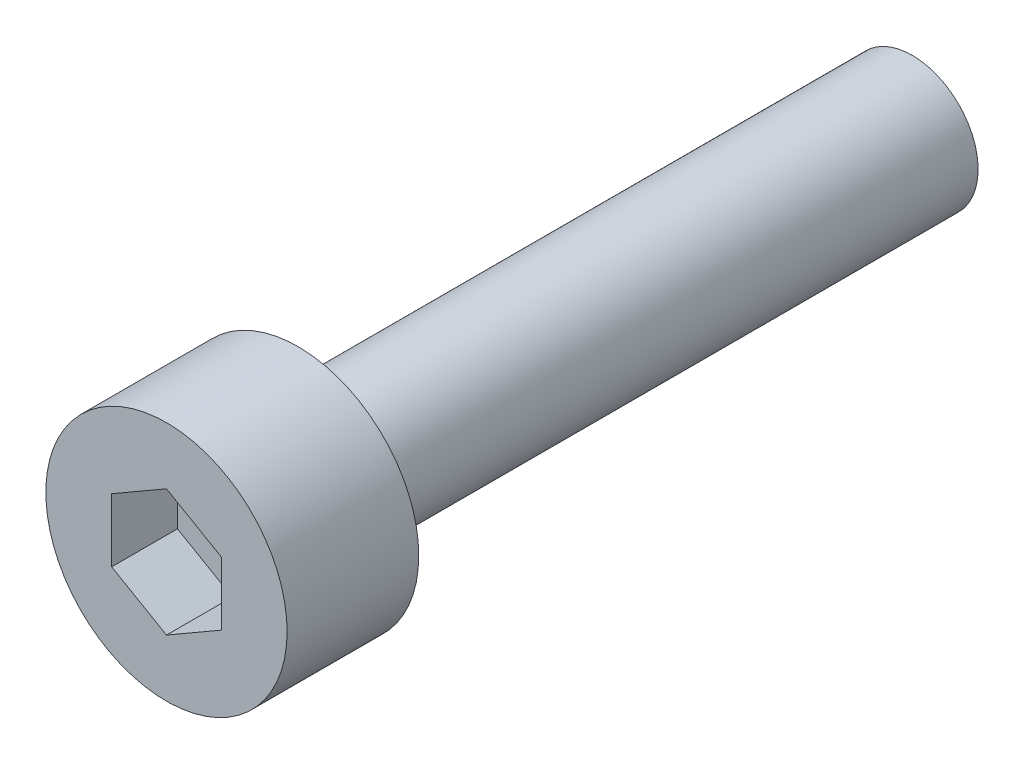
ISO-10303-21;
HEADER;
FILE_DESCRIPTION(('STEP AP214'),'2;1');
FILE_NAME('part.step','',(''),(''),'','','');
FILE_SCHEMA(('AUTOMOTIVE_DESIGN { 1 0 10303 214 1 1 1 1 }'));
ENDSEC;
DATA;
#1=APPLICATION_CONTEXT('core data for automotive mechanical design processes');
#2=APPLICATION_PROTOCOL_DEFINITION('international standard','automotive_design',2000,#1);
#3=PRODUCT_CONTEXT('',#1,'mechanical');
#4=PRODUCT('Part','Part','',(#3));
#5=PRODUCT_RELATED_PRODUCT_CATEGORY('part','',(#4));
#6=PRODUCT_DEFINITION_FORMATION('','',#4);
#7=PRODUCT_DEFINITION_CONTEXT('part definition',#1,'design');
#8=PRODUCT_DEFINITION('design','',#6,#7);
#9=PRODUCT_DEFINITION_SHAPE('','',#8);
#10=(LENGTH_UNIT() NAMED_UNIT(*) SI_UNIT(.MILLI.,.METRE.));
#11=(NAMED_UNIT(*) PLANE_ANGLE_UNIT() SI_UNIT($,.RADIAN.));
#12=(NAMED_UNIT(*) SI_UNIT($,.STERADIAN.) SOLID_ANGLE_UNIT());
#13=UNCERTAINTY_MEASURE_WITH_UNIT(LENGTH_MEASURE(1.E-05),#10,'distance_accuracy_value','');
#14=(GEOMETRIC_REPRESENTATION_CONTEXT(3) GLOBAL_UNCERTAINTY_ASSIGNED_CONTEXT((#13)) GLOBAL_UNIT_ASSIGNED_CONTEXT((#10,
#11,#12)) REPRESENTATION_CONTEXT('',''));
#15=CARTESIAN_POINT('',(0.,0.,0.));
#16=DIRECTION('',(0.,0.,1.));
#17=DIRECTION('',(1.,0.,0.));
#18=AXIS2_PLACEMENT_3D('',#15,#16,#17);
#19=CARTESIAN_POINT('',(0.,0.,3.));
#20=DIRECTION('',(0.,0.,-1.));
#21=DIRECTION('',(-1.,0.,0.));
#22=AXIS2_PLACEMENT_3D('',#19,#20,#21);
#23=CYLINDRICAL_SURFACE('',#22,2.75);
#24=CARTESIAN_POINT('',(0.,0.,3.));
#25=DIRECTION('',(0.,0.,1.));
#26=DIRECTION('',(1.,0.,0.));
#27=AXIS2_PLACEMENT_3D('',#24,#25,#26);
#28=CIRCLE('',#27,2.75);
#29=CARTESIAN_POINT('',(2.75,0.,3.));
#30=VERTEX_POINT('',#29);
#31=EDGE_CURVE('E52',#30,#30,#28,.T.);
#32=ORIENTED_EDGE('',*,*,#31,.F.);
#33=EDGE_LOOP('',(#32));
#34=FACE_BOUND('',#33,.T.);
#35=CARTESIAN_POINT('',(0.,0.,0.));
#36=DIRECTION('',(0.,0.,1.));
#37=DIRECTION('',(1.,0.,0.));
#38=AXIS2_PLACEMENT_3D('',#35,#36,#37);
#39=CIRCLE('',#38,2.75);
#40=CARTESIAN_POINT('',(2.75,0.,0.));
#41=VERTEX_POINT('',#40);
#42=EDGE_CURVE('E46',#41,#41,#39,.T.);
#43=ORIENTED_EDGE('',*,*,#42,.T.);
#44=EDGE_LOOP('',(#43));
#45=FACE_BOUND('',#44,.T.);
#46=ADVANCED_FACE('F43',(#34,#45),#23,.T.);
#47=CARTESIAN_POINT('',(0.,0.,3.));
#48=DIRECTION('',(0.,0.,1.));
#49=DIRECTION('',(1.,0.,0.));
#50=AXIS2_PLACEMENT_3D('',#47,#48,#49);
#51=PLANE('',#50);
#52=DIRECTION('',(0.866025403784439,-0.5,0.));
#53=VECTOR('',#52,1.);
#54=CARTESIAN_POINT('',(-1.25,-0.721687836487032,3.));
#55=LINE('',#54,#53);
#56=CARTESIAN_POINT('',(-1.25,-0.721687836487032,3.));
#57=VERTEX_POINT('',#56);
#58=CARTESIAN_POINT('',(0.,-1.44337567297406,3.));
#59=VERTEX_POINT('',#58);
#60=EDGE_CURVE('E60',#57,#59,#55,.T.);
#61=ORIENTED_EDGE('',*,*,#60,.F.);
#62=DIRECTION('',(0.,-1.,0.));
#63=VECTOR('',#62,1.);
#64=CARTESIAN_POINT('',(-1.25,0.721687836487032,3.));
#65=LINE('',#64,#63);
#66=CARTESIAN_POINT('',(-1.25,0.721687836487032,3.));
#67=VERTEX_POINT('',#66);
#68=EDGE_CURVE('E154',#67,#57,#65,.T.);
#69=ORIENTED_EDGE('',*,*,#68,.F.);
#70=DIRECTION('',(-0.866025403784438,-0.5,0.));
#71=VECTOR('',#70,1.);
#72=CARTESIAN_POINT('',(0.,1.44337567297407,3.));
#73=LINE('',#72,#71);
#74=CARTESIAN_POINT('',(0.,1.44337567297407,3.));
#75=VERTEX_POINT('',#74);
#76=EDGE_CURVE('E151',#75,#67,#73,.T.);
#77=ORIENTED_EDGE('',*,*,#76,.F.);
#78=DIRECTION('',(-0.866025403784439,0.5,0.));
#79=VECTOR('',#78,1.);
#80=CARTESIAN_POINT('',(1.25,0.721687836487033,3.));
#81=LINE('',#80,#79);
#82=CARTESIAN_POINT('',(1.25,0.721687836487033,3.));
#83=VERTEX_POINT('',#82);
#84=EDGE_CURVE('E108',#83,#75,#81,.T.);
#85=ORIENTED_EDGE('',*,*,#84,.F.);
#86=DIRECTION('',(0.,1.,0.));
#87=VECTOR('',#86,1.);
#88=CARTESIAN_POINT('',(1.25,-0.721687836487032,3.));
#89=LINE('',#88,#87);
#90=CARTESIAN_POINT('',(1.25,-0.721687836487032,3.));
#91=VERTEX_POINT('',#90);
#92=EDGE_CURVE('E145',#91,#83,#89,.T.);
#93=ORIENTED_EDGE('',*,*,#92,.F.);
#94=DIRECTION('',(0.866025403784439,0.5,0.));
#95=VECTOR('',#94,1.);
#96=CARTESIAN_POINT('',(0.,-1.44337567297406,3.));
#97=LINE('',#96,#95);
#98=EDGE_CURVE('E140',#59,#91,#97,.T.);
#99=ORIENTED_EDGE('',*,*,#98,.F.);
#100=EDGE_LOOP('',(#61,#69,#77,#85,#93,#99));
#101=FACE_BOUND('',#100,.T.);
#102=ORIENTED_EDGE('',*,*,#31,.T.);
#103=EDGE_LOOP('',(#102));
#104=FACE_BOUND('',#103,.T.);
#105=ADVANCED_FACE('F180',(#101,#104),#51,.T.);
#106=CARTESIAN_POINT('',(0.,0.,0.));
#107=DIRECTION('',(0.,0.,1.));
#108=DIRECTION('',(1.,0.,0.));
#109=AXIS2_PLACEMENT_3D('',#106,#107,#108);
#110=PLANE('',#109);
#111=CARTESIAN_POINT('',(0.,0.,0.));
#112=DIRECTION('',(0.,0.,-1.));
#113=DIRECTION('',(-1.,0.,0.));
#114=AXIS2_PLACEMENT_3D('',#111,#112,#113);
#115=CIRCLE('',#114,1.5);
#116=CARTESIAN_POINT('',(-1.5,0.,0.));
#117=VERTEX_POINT('',#116);
#118=EDGE_CURVE('E11',#117,#117,#115,.T.);
#119=ORIENTED_EDGE('',*,*,#118,.F.);
#120=EDGE_LOOP('',(#119));
#121=FACE_BOUND('',#120,.T.);
#122=ORIENTED_EDGE('',*,*,#42,.F.);
#123=EDGE_LOOP('',(#122));
#124=FACE_BOUND('',#123,.T.);
#125=ADVANCED_FACE('F177',(#121,#124),#110,.F.);
#126=CARTESIAN_POINT('',(-1.25,-0.721687836487032,1.5));
#127=DIRECTION('',(-0.5,-0.866025403784439,0.));
#128=DIRECTION('',(0.866025403784439,-0.5,0.));
#129=AXIS2_PLACEMENT_3D('',#126,#127,#128);
#130=PLANE('',#129);
#131=ORIENTED_EDGE('',*,*,#60,.T.);
#132=DIRECTION('',(0.,0.,1.));
#133=VECTOR('',#132,1.);
#134=CARTESIAN_POINT('',(0.,-1.44337567297406,1.5));
#135=LINE('',#134,#133);
#136=CARTESIAN_POINT('',(0.,-1.44337567297406,1.5));
#137=VERTEX_POINT('',#136);
#138=EDGE_CURVE('E90',#137,#59,#135,.T.);
#139=ORIENTED_EDGE('',*,*,#138,.F.);
#140=DIRECTION('',(0.866025403784439,-0.5,0.));
#141=VECTOR('',#140,1.);
#142=CARTESIAN_POINT('',(-1.25,-0.721687836487032,1.5));
#143=LINE('',#142,#141);
#144=CARTESIAN_POINT('',(-1.25,-0.721687836487032,1.5));
#145=VERTEX_POINT('',#144);
#146=EDGE_CURVE('E157',#145,#137,#143,.T.);
#147=ORIENTED_EDGE('',*,*,#146,.F.);
#148=DIRECTION('',(0.,0.,1.));
#149=VECTOR('',#148,1.);
#150=CARTESIAN_POINT('',(-1.25,-0.721687836487032,1.5));
#151=LINE('',#150,#149);
#152=EDGE_CURVE('E68',#145,#57,#151,.T.);
#153=ORIENTED_EDGE('',*,*,#152,.T.);
#154=EDGE_LOOP('',(#131,#139,#147,#153));
#155=FACE_BOUND('',#154,.T.);
#156=ADVANCED_FACE('F179',(#155),#130,.F.);
#157=CARTESIAN_POINT('',(-1.25,0.721687836487032,1.5));
#158=DIRECTION('',(-1.,0.,0.));
#159=DIRECTION('',(0.,0.,1.));
#160=AXIS2_PLACEMENT_3D('',#157,#158,#159);
#161=PLANE('',#160);
#162=ORIENTED_EDGE('',*,*,#68,.T.);
#163=ORIENTED_EDGE('',*,*,#152,.F.);
#164=DIRECTION('',(0.,-1.,0.));
#165=VECTOR('',#164,1.);
#166=CARTESIAN_POINT('',(-1.25,0.721687836487032,1.5));
#167=LINE('',#166,#165);
#168=CARTESIAN_POINT('',(-1.25,0.721687836487032,1.5));
#169=VERTEX_POINT('',#168);
#170=EDGE_CURVE('E122',#169,#145,#167,.T.);
#171=ORIENTED_EDGE('',*,*,#170,.F.);
#172=DIRECTION('',(0.,0.,1.));
#173=VECTOR('',#172,1.);
#174=CARTESIAN_POINT('',(-1.25,0.721687836487032,1.5));
#175=LINE('',#174,#173);
#176=EDGE_CURVE('E113',#169,#67,#175,.T.);
#177=ORIENTED_EDGE('',*,*,#176,.T.);
#178=EDGE_LOOP('',(#162,#163,#171,#177));
#179=FACE_BOUND('',#178,.T.);
#180=ADVANCED_FACE('F186',(#179),#161,.F.);
#181=CARTESIAN_POINT('',(0.,1.44337567297407,1.5));
#182=DIRECTION('',(-0.5,0.866025403784439,0.));
#183=DIRECTION('',(-0.866025403784439,-0.5,0.));
#184=AXIS2_PLACEMENT_3D('',#181,#182,#183);
#185=PLANE('',#184);
#186=ORIENTED_EDGE('',*,*,#76,.T.);
#187=ORIENTED_EDGE('',*,*,#176,.F.);
#188=DIRECTION('',(-0.866025403784438,-0.5,0.));
#189=VECTOR('',#188,1.);
#190=CARTESIAN_POINT('',(0.,1.44337567297407,1.5));
#191=LINE('',#190,#189);
#192=CARTESIAN_POINT('',(0.,1.44337567297407,1.5));
#193=VERTEX_POINT('',#192);
#194=EDGE_CURVE('E117',#193,#169,#191,.T.);
#195=ORIENTED_EDGE('',*,*,#194,.F.);
#196=DIRECTION('',(0.,0.,1.));
#197=VECTOR('',#196,1.);
#198=CARTESIAN_POINT('',(0.,1.44337567297407,1.5));
#199=LINE('',#198,#197);
#200=EDGE_CURVE('E101',#193,#75,#199,.T.);
#201=ORIENTED_EDGE('',*,*,#200,.T.);
#202=EDGE_LOOP('',(#186,#187,#195,#201));
#203=FACE_BOUND('',#202,.T.);
#204=ADVANCED_FACE('F118',(#203),#185,.F.);
#205=CARTESIAN_POINT('',(1.25,0.721687836487033,1.5));
#206=DIRECTION('',(0.5,0.866025403784439,0.));
#207=DIRECTION('',(-0.866025403784439,0.5,0.));
#208=AXIS2_PLACEMENT_3D('',#205,#206,#207);
#209=PLANE('',#208);
#210=ORIENTED_EDGE('',*,*,#84,.T.);
#211=ORIENTED_EDGE('',*,*,#200,.F.);
#212=DIRECTION('',(-0.866025403784439,0.5,0.));
#213=VECTOR('',#212,1.);
#214=CARTESIAN_POINT('',(1.25,0.721687836487033,1.5));
#215=LINE('',#214,#213);
#216=CARTESIAN_POINT('',(1.25,0.721687836487033,1.5));
#217=VERTEX_POINT('',#216);
#218=EDGE_CURVE('E105',#217,#193,#215,.T.);
#219=ORIENTED_EDGE('',*,*,#218,.F.);
#220=DIRECTION('',(0.,0.,1.));
#221=VECTOR('',#220,1.);
#222=CARTESIAN_POINT('',(1.25,0.721687836487033,1.5));
#223=LINE('',#222,#221);
#224=EDGE_CURVE('E114',#217,#83,#223,.T.);
#225=ORIENTED_EDGE('',*,*,#224,.T.);
#226=EDGE_LOOP('',(#210,#211,#219,#225));
#227=FACE_BOUND('',#226,.T.);
#228=ADVANCED_FACE('F103',(#227),#209,.F.);
#229=CARTESIAN_POINT('',(1.25,-0.721687836487032,1.5));
#230=DIRECTION('',(1.,0.,0.));
#231=DIRECTION('',(0.,1.,0.));
#232=AXIS2_PLACEMENT_3D('',#229,#230,#231);
#233=PLANE('',#232);
#234=ORIENTED_EDGE('',*,*,#92,.T.);
#235=ORIENTED_EDGE('',*,*,#224,.F.);
#236=DIRECTION('',(0.,1.,0.));
#237=VECTOR('',#236,1.);
#238=CARTESIAN_POINT('',(1.25,-0.721687836487032,1.5));
#239=LINE('',#238,#237);
#240=CARTESIAN_POINT('',(1.25,-0.721687836487032,1.5));
#241=VERTEX_POINT('',#240);
#242=EDGE_CURVE('E128',#241,#217,#239,.T.);
#243=ORIENTED_EDGE('',*,*,#242,.F.);
#244=DIRECTION('',(0.,0.,1.));
#245=VECTOR('',#244,1.);
#246=CARTESIAN_POINT('',(1.25,-0.721687836487032,1.5));
#247=LINE('',#246,#245);
#248=EDGE_CURVE('E164',#241,#91,#247,.T.);
#249=ORIENTED_EDGE('',*,*,#248,.T.);
#250=EDGE_LOOP('',(#234,#235,#243,#249));
#251=FACE_BOUND('',#250,.T.);
#252=ADVANCED_FACE('F235',(#251),#233,.F.);
#253=CARTESIAN_POINT('',(0.,-1.44337567297406,1.5));
#254=DIRECTION('',(0.5,-0.866025403784438,0.));
#255=DIRECTION('',(0.866025403784439,0.5,0.));
#256=AXIS2_PLACEMENT_3D('',#253,#254,#255);
#257=PLANE('',#256);
#258=ORIENTED_EDGE('',*,*,#98,.T.);
#259=ORIENTED_EDGE('',*,*,#248,.F.);
#260=DIRECTION('',(0.866025403784439,0.5,0.));
#261=VECTOR('',#260,1.);
#262=CARTESIAN_POINT('',(0.,-1.44337567297406,1.5));
#263=LINE('',#262,#261);
#264=EDGE_CURVE('E132',#137,#241,#263,.T.);
#265=ORIENTED_EDGE('',*,*,#264,.F.);
#266=ORIENTED_EDGE('',*,*,#138,.T.);
#267=EDGE_LOOP('',(#258,#259,#265,#266));
#268=FACE_BOUND('',#267,.T.);
#269=ADVANCED_FACE('F245',(#268),#257,.F.);
#270=CARTESIAN_POINT('',(0.,0.,1.5));
#271=DIRECTION('',(0.,0.,1.));
#272=DIRECTION('',(1.,0.,0.));
#273=AXIS2_PLACEMENT_3D('',#270,#271,#272);
#274=PLANE('',#273);
#275=ORIENTED_EDGE('',*,*,#146,.T.);
#276=ORIENTED_EDGE('',*,*,#264,.T.);
#277=ORIENTED_EDGE('',*,*,#242,.T.);
#278=ORIENTED_EDGE('',*,*,#218,.T.);
#279=ORIENTED_EDGE('',*,*,#194,.T.);
#280=ORIENTED_EDGE('',*,*,#170,.T.);
#281=EDGE_LOOP('',(#275,#276,#277,#278,#279,#280));
#282=FACE_BOUND('',#281,.T.);
#283=ADVANCED_FACE('F125',(#282),#274,.T.);
#284=CARTESIAN_POINT('',(0.,0.,-14.));
#285=DIRECTION('',(0.,0.,1.));
#286=DIRECTION('',(1.,0.,0.));
#287=AXIS2_PLACEMENT_3D('',#284,#285,#286);
#288=CYLINDRICAL_SURFACE('',#287,1.5);
#289=CARTESIAN_POINT('',(0.,0.,-14.));
#290=DIRECTION('',(0.,0.,-1.));
#291=DIRECTION('',(-1.,0.,0.));
#292=AXIS2_PLACEMENT_3D('',#289,#290,#291);
#293=CIRCLE('',#292,1.5);
#294=CARTESIAN_POINT('',(-1.5,0.,-14.));
#295=VERTEX_POINT('',#294);
#296=EDGE_CURVE('E141',#295,#295,#293,.T.);
#297=ORIENTED_EDGE('',*,*,#296,.F.);
#298=EDGE_LOOP('',(#297));
#299=FACE_BOUND('',#298,.T.);
#300=ORIENTED_EDGE('',*,*,#118,.T.);
#301=EDGE_LOOP('',(#300));
#302=FACE_BOUND('',#301,.T.);
#303=ADVANCED_FACE('F265',(#299,#302),#288,.T.);
#304=CARTESIAN_POINT('',(0.,0.,-14.));
#305=DIRECTION('',(0.,0.,-1.));
#306=DIRECTION('',(-1.,0.,0.));
#307=AXIS2_PLACEMENT_3D('',#304,#305,#306);
#308=PLANE('',#307);
#309=ORIENTED_EDGE('',*,*,#296,.T.);
#310=EDGE_LOOP('',(#309));
#311=FACE_BOUND('',#310,.T.);
#312=ADVANCED_FACE('F280',(#311),#308,.T.);
#313=CLOSED_SHELL('',(#46,#105,#125,#156,#180,#204,#228,#252,#269,#283,#303,#312));
#314=MANIFOLD_SOLID_BREP('B2',#313);
#315=ADVANCED_BREP_SHAPE_REPRESENTATION('',(#18,#314),#14);
#316=SHAPE_DEFINITION_REPRESENTATION(#9,#315);
ENDSEC;
END-ISO-10303-21;
